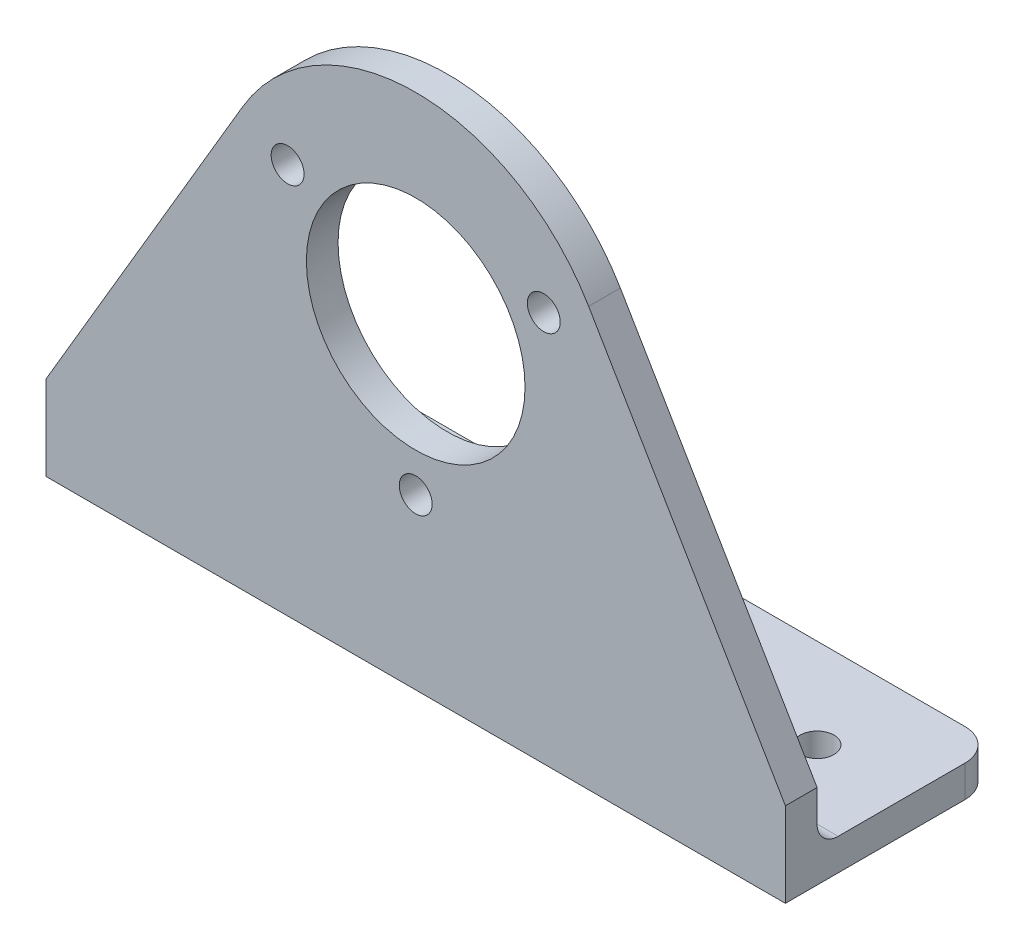
ISO-10303-21;
HEADER;
FILE_DESCRIPTION(('STEP AP214'),'2;1');
FILE_NAME('part.step','',(''),(''),'','','');
FILE_SCHEMA(('AUTOMOTIVE_DESIGN { 1 0 10303 214 1 1 1 1 }'));
ENDSEC;
DATA;
#1=APPLICATION_CONTEXT('core data for automotive mechanical design processes');
#2=APPLICATION_PROTOCOL_DEFINITION('international standard','automotive_design',2000,#1);
#3=PRODUCT_CONTEXT('',#1,'mechanical');
#4=PRODUCT('Part','Part','',(#3));
#5=PRODUCT_RELATED_PRODUCT_CATEGORY('part','',(#4));
#6=PRODUCT_DEFINITION_FORMATION('','',#4);
#7=PRODUCT_DEFINITION_CONTEXT('part definition',#1,'design');
#8=PRODUCT_DEFINITION('design','',#6,#7);
#9=PRODUCT_DEFINITION_SHAPE('','',#8);
#10=(LENGTH_UNIT() NAMED_UNIT(*) SI_UNIT(.MILLI.,.METRE.));
#11=(NAMED_UNIT(*) PLANE_ANGLE_UNIT() SI_UNIT($,.RADIAN.));
#12=(NAMED_UNIT(*) SI_UNIT($,.STERADIAN.) SOLID_ANGLE_UNIT());
#13=UNCERTAINTY_MEASURE_WITH_UNIT(LENGTH_MEASURE(1.E-05),#10,'distance_accuracy_value','');
#14=(GEOMETRIC_REPRESENTATION_CONTEXT(3) GLOBAL_UNCERTAINTY_ASSIGNED_CONTEXT((#13)) GLOBAL_UNIT_ASSIGNED_CONTEXT((#10,
#11,#12)) REPRESENTATION_CONTEXT('',''));
#15=CARTESIAN_POINT('',(0.,0.,0.));
#16=DIRECTION('',(0.,0.,1.));
#17=DIRECTION('',(1.,0.,0.));
#18=AXIS2_PLACEMENT_3D('',#15,#16,#17);
#19=CARTESIAN_POINT('',(0.,3.,0.));
#20=DIRECTION('',(1.,0.,0.));
#21=DIRECTION('',(0.,0.,-1.));
#22=AXIS2_PLACEMENT_3D('',#19,#20,#21);
#23=PLANE('',#22);
#24=DIRECTION('',(0.,0.,1.));
#25=VECTOR('',#24,1.);
#26=CARTESIAN_POINT('',(0.,3.,0.));
#27=LINE('',#26,#25);
#28=CARTESIAN_POINT('',(0.,3.,-14.));
#29=VERTEX_POINT('',#28);
#30=CARTESIAN_POINT('',(0.,3.,-2.));
#31=VERTEX_POINT('',#30);
#32=EDGE_CURVE('E181',#29,#31,#27,.T.);
#33=ORIENTED_EDGE('',*,*,#32,.F.);
#34=DIRECTION('',(0.,-1.,0.));
#35=VECTOR('',#34,1.);
#36=CARTESIAN_POINT('',(0.,3.,-14.));
#37=LINE('',#36,#35);
#38=CARTESIAN_POINT('',(0.,0.,-14.));
#39=VERTEX_POINT('',#38);
#40=EDGE_CURVE('E127',#29,#39,#37,.T.);
#41=ORIENTED_EDGE('',*,*,#40,.T.);
#42=DIRECTION('',(0.,0.,1.));
#43=VECTOR('',#42,1.);
#44=CARTESIAN_POINT('',(0.,0.,0.));
#45=LINE('',#44,#43);
#46=CARTESIAN_POINT('',(0.,0.,3.));
#47=VERTEX_POINT('',#46);
#48=EDGE_CURVE('E120',#39,#47,#45,.T.);
#49=ORIENTED_EDGE('',*,*,#48,.T.);
#50=DIRECTION('',(0.,-1.,0.));
#51=VECTOR('',#50,1.);
#52=CARTESIAN_POINT('',(0.,8.,3.));
#53=LINE('',#52,#51);
#54=CARTESIAN_POINT('',(0.,8.,3.));
#55=VERTEX_POINT('',#54);
#56=EDGE_CURVE('E125',#55,#47,#53,.T.);
#57=ORIENTED_EDGE('',*,*,#56,.F.);
#58=DIRECTION('',(0.,0.,-1.));
#59=VECTOR('',#58,1.);
#60=CARTESIAN_POINT('',(0.,8.,3.));
#61=LINE('',#60,#59);
#62=CARTESIAN_POINT('',(0.,8.,0.));
#63=VERTEX_POINT('',#62);
#64=EDGE_CURVE('E160',#55,#63,#61,.T.);
#65=ORIENTED_EDGE('',*,*,#64,.T.);
#66=DIRECTION('',(0.,-1.,0.));
#67=VECTOR('',#66,1.);
#68=CARTESIAN_POINT('',(0.,8.,0.));
#69=LINE('',#68,#67);
#70=CARTESIAN_POINT('',(0.,5.,0.));
#71=VERTEX_POINT('',#70);
#72=EDGE_CURVE('E166',#63,#71,#69,.T.);
#73=ORIENTED_EDGE('',*,*,#72,.T.);
#74=CARTESIAN_POINT('',(0.,5.,-2.));
#75=DIRECTION('',(1.,0.,0.));
#76=DIRECTION('',(0.,0.,-1.));
#77=AXIS2_PLACEMENT_3D('',#74,#75,#76);
#78=CIRCLE('',#77,2.);
#79=EDGE_CURVE('E11',#71,#31,#78,.T.);
#80=ORIENTED_EDGE('',*,*,#79,.T.);
#81=EDGE_LOOP('',(#33,#41,#49,#57,#65,#73,#80));
#82=FACE_BOUND('',#81,.T.);
#83=ADVANCED_FACE('F37',(#82),#23,.F.);
#84=CARTESIAN_POINT('',(70.,3.,0.));
#85=DIRECTION('',(-1.,0.,0.));
#86=DIRECTION('',(0.,0.,1.));
#87=AXIS2_PLACEMENT_3D('',#84,#85,#86);
#88=PLANE('',#87);
#89=DIRECTION('',(0.,0.,-1.));
#90=VECTOR('',#89,1.);
#91=CARTESIAN_POINT('',(70.,0.,0.));
#92=LINE('',#91,#90);
#93=CARTESIAN_POINT('',(70.,0.,3.));
#94=VERTEX_POINT('',#93);
#95=CARTESIAN_POINT('',(70.,0.,-14.));
#96=VERTEX_POINT('',#95);
#97=EDGE_CURVE('E129',#94,#96,#92,.T.);
#98=ORIENTED_EDGE('',*,*,#97,.T.);
#99=DIRECTION('',(0.,-1.,0.));
#100=VECTOR('',#99,1.);
#101=CARTESIAN_POINT('',(70.,3.,-14.));
#102=LINE('',#101,#100);
#103=CARTESIAN_POINT('',(70.,3.,-14.));
#104=VERTEX_POINT('',#103);
#105=EDGE_CURVE('E229',#96,#104,#102,.F.);
#106=ORIENTED_EDGE('',*,*,#105,.T.);
#107=DIRECTION('',(0.,0.,-1.));
#108=VECTOR('',#107,1.);
#109=CARTESIAN_POINT('',(70.,3.,0.));
#110=LINE('',#109,#108);
#111=CARTESIAN_POINT('',(70.,3.,-2.));
#112=VERTEX_POINT('',#111);
#113=EDGE_CURVE('E175',#112,#104,#110,.T.);
#114=ORIENTED_EDGE('',*,*,#113,.F.);
#115=CARTESIAN_POINT('',(70.,5.,-2.));
#116=DIRECTION('',(-1.,0.,0.));
#117=DIRECTION('',(0.,0.,1.));
#118=AXIS2_PLACEMENT_3D('',#115,#116,#117);
#119=CIRCLE('',#118,2.);
#120=CARTESIAN_POINT('',(70.,5.,0.));
#121=VERTEX_POINT('',#120);
#122=EDGE_CURVE('E45',#112,#121,#119,.T.);
#123=ORIENTED_EDGE('',*,*,#122,.T.);
#124=DIRECTION('',(0.,1.,0.));
#125=VECTOR('',#124,1.);
#126=CARTESIAN_POINT('',(70.,0.,0.));
#127=LINE('',#126,#125);
#128=CARTESIAN_POINT('',(70.,8.,0.));
#129=VERTEX_POINT('',#128);
#130=EDGE_CURVE('E169',#121,#129,#127,.T.);
#131=ORIENTED_EDGE('',*,*,#130,.T.);
#132=DIRECTION('',(0.,0.,-1.));
#133=VECTOR('',#132,1.);
#134=CARTESIAN_POINT('',(70.,8.,3.));
#135=LINE('',#134,#133);
#136=CARTESIAN_POINT('',(70.,8.,3.));
#137=VERTEX_POINT('',#136);
#138=EDGE_CURVE('E130',#137,#129,#135,.T.);
#139=ORIENTED_EDGE('',*,*,#138,.F.);
#140=DIRECTION('',(0.,1.,0.));
#141=VECTOR('',#140,1.);
#142=CARTESIAN_POINT('',(70.,0.,3.));
#143=LINE('',#142,#141);
#144=EDGE_CURVE('E139',#94,#137,#143,.T.);
#145=ORIENTED_EDGE('',*,*,#144,.F.);
#146=EDGE_LOOP('',(#98,#106,#114,#123,#131,#139,#145));
#147=FACE_BOUND('',#146,.T.);
#148=ADVANCED_FACE('F227',(#147),#88,.F.);
#149=CARTESIAN_POINT('',(0.,3.,-17.));
#150=DIRECTION('',(0.,0.,1.));
#151=DIRECTION('',(1.,0.,0.));
#152=AXIS2_PLACEMENT_3D('',#149,#150,#151);
#153=PLANE('',#152);
#154=DIRECTION('',(-1.,0.,0.));
#155=VECTOR('',#154,1.);
#156=CARTESIAN_POINT('',(0.,3.,-17.));
#157=LINE('',#156,#155);
#158=CARTESIAN_POINT('',(67.,3.,-17.));
#159=VERTEX_POINT('',#158);
#160=CARTESIAN_POINT('',(3.,3.,-17.));
#161=VERTEX_POINT('',#160);
#162=EDGE_CURVE('E172',#159,#161,#157,.T.);
#163=ORIENTED_EDGE('',*,*,#162,.F.);
#164=DIRECTION('',(0.,-1.,0.));
#165=VECTOR('',#164,1.);
#166=CARTESIAN_POINT('',(67.,3.,-17.));
#167=LINE('',#166,#165);
#168=CARTESIAN_POINT('',(67.,0.,-17.));
#169=VERTEX_POINT('',#168);
#170=EDGE_CURVE('E239',#159,#169,#167,.T.);
#171=ORIENTED_EDGE('',*,*,#170,.T.);
#172=DIRECTION('',(-1.,0.,0.));
#173=VECTOR('',#172,1.);
#174=CARTESIAN_POINT('',(0.,0.,-17.));
#175=LINE('',#174,#173);
#176=CARTESIAN_POINT('',(3.,0.,-17.));
#177=VERTEX_POINT('',#176);
#178=EDGE_CURVE('E178',#169,#177,#175,.T.);
#179=ORIENTED_EDGE('',*,*,#178,.T.);
#180=DIRECTION('',(0.,-1.,0.));
#181=VECTOR('',#180,1.);
#182=CARTESIAN_POINT('',(3.,3.,-17.));
#183=LINE('',#182,#181);
#184=EDGE_CURVE('E174',#177,#161,#183,.F.);
#185=ORIENTED_EDGE('',*,*,#184,.T.);
#186=EDGE_LOOP('',(#163,#171,#179,#185));
#187=FACE_BOUND('',#186,.T.);
#188=ADVANCED_FACE('F249',(#187),#153,.F.);
#189=CARTESIAN_POINT('',(0.,3.,0.));
#190=DIRECTION('',(0.,-1.,0.));
#191=DIRECTION('',(0.,0.,-1.));
#192=AXIS2_PLACEMENT_3D('',#189,#190,#191);
#193=PLANE('',#192);
#194=CARTESIAN_POINT('',(61.5,3.,-8.5));
#195=DIRECTION('',(0.,1.,0.));
#196=DIRECTION('',(0.,0.,1.));
#197=AXIS2_PLACEMENT_3D('',#194,#195,#196);
#198=CIRCLE('',#197,1.6);
#199=CARTESIAN_POINT('',(61.5,3.,-6.9));
#200=VERTEX_POINT('',#199);
#201=EDGE_CURVE('E316',#200,#200,#198,.T.);
#202=ORIENTED_EDGE('',*,*,#201,.F.);
#203=EDGE_LOOP('',(#202));
#204=FACE_BOUND('',#203,.T.);
#205=CARTESIAN_POINT('',(8.5,3.,-8.5));
#206=DIRECTION('',(0.,1.,0.));
#207=DIRECTION('',(0.,0.,1.));
#208=AXIS2_PLACEMENT_3D('',#205,#206,#207);
#209=CIRCLE('',#208,1.6);
#210=CARTESIAN_POINT('',(8.5,3.,-6.9));
#211=VERTEX_POINT('',#210);
#212=EDGE_CURVE('E318',#211,#211,#209,.T.);
#213=ORIENTED_EDGE('',*,*,#212,.F.);
#214=EDGE_LOOP('',(#213));
#215=FACE_BOUND('',#214,.T.);
#216=ORIENTED_EDGE('',*,*,#32,.T.);
#217=DIRECTION('',(1.,0.,0.));
#218=VECTOR('',#217,1.);
#219=CARTESIAN_POINT('',(70.,3.,-2.));
#220=LINE('',#219,#218);
#221=EDGE_CURVE('E190',#31,#112,#220,.T.);
#222=ORIENTED_EDGE('',*,*,#221,.T.);
#223=ORIENTED_EDGE('',*,*,#113,.T.);
#224=CARTESIAN_POINT('',(67.,3.,-14.));
#225=DIRECTION('',(0.,-1.,0.));
#226=DIRECTION('',(0.,0.,-1.));
#227=AXIS2_PLACEMENT_3D('',#224,#225,#226);
#228=CIRCLE('',#227,3.);
#229=EDGE_CURVE('E236',#104,#159,#228,.F.);
#230=ORIENTED_EDGE('',*,*,#229,.T.);
#231=ORIENTED_EDGE('',*,*,#162,.T.);
#232=CARTESIAN_POINT('',(3.,3.,-14.));
#233=DIRECTION('',(0.,-1.,0.));
#234=DIRECTION('',(0.,0.,-1.));
#235=AXIS2_PLACEMENT_3D('',#232,#233,#234);
#236=CIRCLE('',#235,3.);
#237=EDGE_CURVE('E232',#161,#29,#236,.F.);
#238=ORIENTED_EDGE('',*,*,#237,.T.);
#239=EDGE_LOOP('',(#216,#222,#223,#230,#231,#238));
#240=FACE_BOUND('',#239,.T.);
#241=ADVANCED_FACE('F225',(#204,#215,#240),#193,.F.);
#242=CARTESIAN_POINT('',(0.,0.,0.));
#243=DIRECTION('',(0.,-1.,0.));
#244=DIRECTION('',(0.,0.,-1.));
#245=AXIS2_PLACEMENT_3D('',#242,#243,#244);
#246=PLANE('',#245);
#247=CARTESIAN_POINT('',(61.5,0.,-8.5));
#248=DIRECTION('',(0.,1.,0.));
#249=DIRECTION('',(0.,0.,1.));
#250=AXIS2_PLACEMENT_3D('',#247,#248,#249);
#251=CIRCLE('',#250,1.6);
#252=CARTESIAN_POINT('',(61.5,0.,-6.9));
#253=VERTEX_POINT('',#252);
#254=EDGE_CURVE('E313',#253,#253,#251,.T.);
#255=ORIENTED_EDGE('',*,*,#254,.T.);
#256=EDGE_LOOP('',(#255));
#257=FACE_BOUND('',#256,.T.);
#258=CARTESIAN_POINT('',(8.5,0.,-8.5));
#259=DIRECTION('',(0.,1.,0.));
#260=DIRECTION('',(0.,0.,1.));
#261=AXIS2_PLACEMENT_3D('',#258,#259,#260);
#262=CIRCLE('',#261,1.6);
#263=CARTESIAN_POINT('',(8.5,0.,-6.9));
#264=VERTEX_POINT('',#263);
#265=EDGE_CURVE('E321',#264,#264,#262,.T.);
#266=ORIENTED_EDGE('',*,*,#265,.T.);
#267=EDGE_LOOP('',(#266));
#268=FACE_BOUND('',#267,.T.);
#269=ORIENTED_EDGE('',*,*,#178,.F.);
#270=CARTESIAN_POINT('',(67.,0.,-14.));
#271=DIRECTION('',(0.,-1.,0.));
#272=DIRECTION('',(0.,0.,-1.));
#273=AXIS2_PLACEMENT_3D('',#270,#271,#272);
#274=CIRCLE('',#273,3.);
#275=EDGE_CURVE('E233',#169,#96,#274,.T.);
#276=ORIENTED_EDGE('',*,*,#275,.T.);
#277=ORIENTED_EDGE('',*,*,#97,.F.);
#278=DIRECTION('',(1.,0.,0.));
#279=VECTOR('',#278,1.);
#280=CARTESIAN_POINT('',(0.,0.,3.));
#281=LINE('',#280,#279);
#282=EDGE_CURVE('E133',#47,#94,#281,.T.);
#283=ORIENTED_EDGE('',*,*,#282,.F.);
#284=ORIENTED_EDGE('',*,*,#48,.F.);
#285=CARTESIAN_POINT('',(3.,0.,-14.));
#286=DIRECTION('',(0.,-1.,0.));
#287=DIRECTION('',(0.,0.,-1.));
#288=AXIS2_PLACEMENT_3D('',#285,#286,#287);
#289=CIRCLE('',#288,3.);
#290=EDGE_CURVE('E245',#39,#177,#289,.T.);
#291=ORIENTED_EDGE('',*,*,#290,.T.);
#292=EDGE_LOOP('',(#269,#276,#277,#283,#284,#291));
#293=FACE_BOUND('',#292,.T.);
#294=ADVANCED_FACE('F135',(#257,#268,#293),#246,.T.);
#295=CARTESIAN_POINT('',(35.,30.,3.));
#296=DIRECTION('',(0.,0.,1.));
#297=DIRECTION('',(1.,0.,0.));
#298=AXIS2_PLACEMENT_3D('',#295,#296,#297);
#299=PLANE('',#298);
#300=CARTESIAN_POINT('',(22.8756443470179,37.0000000000001,3.));
#301=DIRECTION('',(0.,0.,1.));
#302=DIRECTION('',(1.,0.,0.));
#303=AXIS2_PLACEMENT_3D('',#300,#301,#302);
#304=CIRCLE('',#303,1.55914497782311);
#305=CARTESIAN_POINT('',(24.434789324841,37.0000000000001,3.));
#306=VERTEX_POINT('',#305);
#307=EDGE_CURVE('E333',#306,#306,#304,.T.);
#308=ORIENTED_EDGE('',*,*,#307,.F.);
#309=EDGE_LOOP('',(#308));
#310=FACE_BOUND('',#309,.T.);
#311=CARTESIAN_POINT('',(35.,30.,3.));
#312=DIRECTION('',(0.,0.,1.));
#313=DIRECTION('',(1.,0.,0.));
#314=AXIS2_PLACEMENT_3D('',#311,#312,#313);
#315=CIRCLE('',#314,10.35);
#316=CARTESIAN_POINT('',(45.35,30.,3.));
#317=VERTEX_POINT('',#316);
#318=EDGE_CURVE('E170',#317,#317,#315,.T.);
#319=ORIENTED_EDGE('',*,*,#318,.F.);
#320=EDGE_LOOP('',(#319));
#321=FACE_BOUND('',#320,.T.);
#322=ORIENTED_EDGE('',*,*,#56,.T.);
#323=ORIENTED_EDGE('',*,*,#282,.T.);
#324=ORIENTED_EDGE('',*,*,#144,.T.);
#325=DIRECTION('',(-0.507331294644825,0.861751099491034,0.));
#326=VECTOR('',#325,1.);
#327=CARTESIAN_POINT('',(70.,8.,3.));
#328=LINE('',#327,#326);
#329=CARTESIAN_POINT('',(51.3732708903297,39.6392945982517,3.));
#330=VERTEX_POINT('',#329);
#331=EDGE_CURVE('E155',#137,#330,#328,.T.);
#332=ORIENTED_EDGE('',*,*,#331,.T.);
#333=CARTESIAN_POINT('',(35.,30.,3.));
#334=DIRECTION('',(0.,0.,1.));
#335=DIRECTION('',(1.,0.,0.));
#336=AXIS2_PLACEMENT_3D('',#333,#334,#335);
#337=CIRCLE('',#336,19.);
#338=CARTESIAN_POINT('',(18.6267291096704,39.6392945982517,3.));
#339=VERTEX_POINT('',#338);
#340=EDGE_CURVE('E157',#330,#339,#337,.T.);
#341=ORIENTED_EDGE('',*,*,#340,.T.);
#342=DIRECTION('',(-0.507331294644826,-0.861751099491033,0.));
#343=VECTOR('',#342,1.);
#344=CARTESIAN_POINT('',(0.,8.,3.));
#345=LINE('',#344,#343);
#346=EDGE_CURVE('E144',#339,#55,#345,.T.);
#347=ORIENTED_EDGE('',*,*,#346,.T.);
#348=EDGE_LOOP('',(#322,#323,#324,#332,#341,#347));
#349=FACE_BOUND('',#348,.T.);
#350=CARTESIAN_POINT('',(35.,16.,3.));
#351=DIRECTION('',(0.,0.,1.));
#352=DIRECTION('',(1.,0.,0.));
#353=AXIS2_PLACEMENT_3D('',#350,#351,#352);
#354=CIRCLE('',#353,1.55914497782311);
#355=CARTESIAN_POINT('',(36.5591449778231,16.,3.));
#356=VERTEX_POINT('',#355);
#357=EDGE_CURVE('E339',#356,#356,#354,.T.);
#358=ORIENTED_EDGE('',*,*,#357,.F.);
#359=EDGE_LOOP('',(#358));
#360=FACE_BOUND('',#359,.T.);
#361=CARTESIAN_POINT('',(47.1243556529822,36.9999999999999,3.));
#362=DIRECTION('',(0.,0.,1.));
#363=DIRECTION('',(1.,0.,0.));
#364=AXIS2_PLACEMENT_3D('',#361,#362,#363);
#365=CIRCLE('',#364,1.5591449778231);
#366=CARTESIAN_POINT('',(48.6835006308053,36.9999999999999,3.));
#367=VERTEX_POINT('',#366);
#368=EDGE_CURVE('E327',#367,#367,#365,.T.);
#369=ORIENTED_EDGE('',*,*,#368,.F.);
#370=EDGE_LOOP('',(#369));
#371=FACE_BOUND('',#370,.T.);
#372=ADVANCED_FACE('F141',(#310,#321,#349,#360,#371),#299,.T.);
#373=CARTESIAN_POINT('',(35.,30.,0.));
#374=DIRECTION('',(0.,0.,1.));
#375=DIRECTION('',(1.,0.,0.));
#376=AXIS2_PLACEMENT_3D('',#373,#374,#375);
#377=PLANE('',#376);
#378=ORIENTED_EDGE('',*,*,#130,.F.);
#379=DIRECTION('',(1.,0.,0.));
#380=VECTOR('',#379,1.);
#381=CARTESIAN_POINT('',(0.,5.,0.));
#382=LINE('',#381,#380);
#383=EDGE_CURVE('E58',#121,#71,#382,.F.);
#384=ORIENTED_EDGE('',*,*,#383,.T.);
#385=ORIENTED_EDGE('',*,*,#72,.F.);
#386=DIRECTION('',(-0.507331294644826,-0.861751099491033,0.));
#387=VECTOR('',#386,1.);
#388=CARTESIAN_POINT('',(0.,8.,0.));
#389=LINE('',#388,#387);
#390=CARTESIAN_POINT('',(18.6267291096704,39.6392945982517,0.));
#391=VERTEX_POINT('',#390);
#392=EDGE_CURVE('E146',#391,#63,#389,.T.);
#393=ORIENTED_EDGE('',*,*,#392,.F.);
#394=CARTESIAN_POINT('',(35.,30.,0.));
#395=DIRECTION('',(0.,0.,1.));
#396=DIRECTION('',(1.,0.,0.));
#397=AXIS2_PLACEMENT_3D('',#394,#395,#396);
#398=CIRCLE('',#397,19.);
#399=CARTESIAN_POINT('',(51.3732708903297,39.6392945982517,0.));
#400=VERTEX_POINT('',#399);
#401=EDGE_CURVE('E148',#400,#391,#398,.T.);
#402=ORIENTED_EDGE('',*,*,#401,.F.);
#403=DIRECTION('',(-0.507331294644825,0.861751099491034,0.));
#404=VECTOR('',#403,1.);
#405=CARTESIAN_POINT('',(70.,8.,0.));
#406=LINE('',#405,#404);
#407=EDGE_CURVE('E195',#129,#400,#406,.T.);
#408=ORIENTED_EDGE('',*,*,#407,.F.);
#409=EDGE_LOOP('',(#378,#384,#385,#393,#402,#408));
#410=FACE_BOUND('',#409,.T.);
#411=CARTESIAN_POINT('',(22.8756443470179,37.0000000000001,0.));
#412=DIRECTION('',(0.,0.,1.));
#413=DIRECTION('',(1.,0.,0.));
#414=AXIS2_PLACEMENT_3D('',#411,#412,#413);
#415=CIRCLE('',#414,1.55914497782311);
#416=CARTESIAN_POINT('',(24.434789324841,37.0000000000001,0.));
#417=VERTEX_POINT('',#416);
#418=EDGE_CURVE('E330',#417,#417,#415,.T.);
#419=ORIENTED_EDGE('',*,*,#418,.T.);
#420=EDGE_LOOP('',(#419));
#421=FACE_BOUND('',#420,.T.);
#422=CARTESIAN_POINT('',(35.,30.,0.));
#423=DIRECTION('',(0.,0.,1.));
#424=DIRECTION('',(1.,0.,0.));
#425=AXIS2_PLACEMENT_3D('',#422,#423,#424);
#426=CIRCLE('',#425,10.35);
#427=CARTESIAN_POINT('',(45.35,30.,0.));
#428=VERTEX_POINT('',#427);
#429=EDGE_CURVE('E151',#428,#428,#426,.T.);
#430=ORIENTED_EDGE('',*,*,#429,.T.);
#431=EDGE_LOOP('',(#430));
#432=FACE_BOUND('',#431,.T.);
#433=CARTESIAN_POINT('',(35.,16.,0.));
#434=DIRECTION('',(0.,0.,1.));
#435=DIRECTION('',(1.,0.,0.));
#436=AXIS2_PLACEMENT_3D('',#433,#434,#435);
#437=CIRCLE('',#436,1.55914497782311);
#438=CARTESIAN_POINT('',(36.5591449778231,16.,0.));
#439=VERTEX_POINT('',#438);
#440=EDGE_CURVE('E336',#439,#439,#437,.T.);
#441=ORIENTED_EDGE('',*,*,#440,.T.);
#442=EDGE_LOOP('',(#441));
#443=FACE_BOUND('',#442,.T.);
#444=CARTESIAN_POINT('',(47.1243556529822,36.9999999999999,0.));
#445=DIRECTION('',(0.,0.,1.));
#446=DIRECTION('',(1.,0.,0.));
#447=AXIS2_PLACEMENT_3D('',#444,#445,#446);
#448=CIRCLE('',#447,1.5591449778231);
#449=CARTESIAN_POINT('',(48.6835006308053,36.9999999999999,0.));
#450=VERTEX_POINT('',#449);
#451=EDGE_CURVE('E324',#450,#450,#448,.T.);
#452=ORIENTED_EDGE('',*,*,#451,.T.);
#453=EDGE_LOOP('',(#452));
#454=FACE_BOUND('',#453,.T.);
#455=ADVANCED_FACE('F213',(#410,#421,#432,#443,#454),#377,.F.);
#456=CARTESIAN_POINT('',(70.,8.,3.));
#457=DIRECTION('',(-0.861751099491034,-0.507331294644825,0.));
#458=DIRECTION('',(0.507331294644825,-0.861751099491034,0.));
#459=AXIS2_PLACEMENT_3D('',#456,#457,#458);
#460=PLANE('',#459);
#461=ORIENTED_EDGE('',*,*,#407,.T.);
#462=DIRECTION('',(0.,0.,-1.));
#463=VECTOR('',#462,1.);
#464=CARTESIAN_POINT('',(51.3732708903297,39.6392945982517,3.));
#465=LINE('',#464,#463);
#466=EDGE_CURVE('E207',#330,#400,#465,.T.);
#467=ORIENTED_EDGE('',*,*,#466,.F.);
#468=ORIENTED_EDGE('',*,*,#331,.F.);
#469=ORIENTED_EDGE('',*,*,#138,.T.);
#470=EDGE_LOOP('',(#461,#467,#468,#469));
#471=FACE_BOUND('',#470,.T.);
#472=ADVANCED_FACE('F212',(#471),#460,.F.);
#473=CARTESIAN_POINT('',(35.,30.,3.));
#474=DIRECTION('',(0.,0.,-1.));
#475=DIRECTION('',(-1.,0.,0.));
#476=AXIS2_PLACEMENT_3D('',#473,#474,#475);
#477=CYLINDRICAL_SURFACE('',#476,19.);
#478=ORIENTED_EDGE('',*,*,#401,.T.);
#479=DIRECTION('',(0.,0.,-1.));
#480=VECTOR('',#479,1.);
#481=CARTESIAN_POINT('',(18.6267291096704,39.6392945982517,3.));
#482=LINE('',#481,#480);
#483=EDGE_CURVE('E205',#339,#391,#482,.T.);
#484=ORIENTED_EDGE('',*,*,#483,.F.);
#485=ORIENTED_EDGE('',*,*,#340,.F.);
#486=ORIENTED_EDGE('',*,*,#466,.T.);
#487=EDGE_LOOP('',(#478,#484,#485,#486));
#488=FACE_BOUND('',#487,.T.);
#489=ADVANCED_FACE('F217',(#488),#477,.T.);
#490=CARTESIAN_POINT('',(0.,8.,3.));
#491=DIRECTION('',(0.861751099491033,-0.507331294644826,0.));
#492=DIRECTION('',(0.507331294644826,0.861751099491033,0.));
#493=AXIS2_PLACEMENT_3D('',#490,#491,#492);
#494=PLANE('',#493);
#495=ORIENTED_EDGE('',*,*,#392,.T.);
#496=ORIENTED_EDGE('',*,*,#64,.F.);
#497=ORIENTED_EDGE('',*,*,#346,.F.);
#498=ORIENTED_EDGE('',*,*,#483,.T.);
#499=EDGE_LOOP('',(#495,#496,#497,#498));
#500=FACE_BOUND('',#499,.T.);
#501=ADVANCED_FACE('F219',(#500),#494,.F.);
#502=CARTESIAN_POINT('',(35.,30.,3.));
#503=DIRECTION('',(0.,0.,-1.));
#504=DIRECTION('',(-1.,0.,0.));
#505=AXIS2_PLACEMENT_3D('',#502,#503,#504);
#506=CYLINDRICAL_SURFACE('',#505,10.35);
#507=ORIENTED_EDGE('',*,*,#318,.T.);
#508=EDGE_LOOP('',(#507));
#509=FACE_BOUND('',#508,.T.);
#510=ORIENTED_EDGE('',*,*,#429,.F.);
#511=EDGE_LOOP('',(#510));
#512=FACE_BOUND('',#511,.T.);
#513=ADVANCED_FACE('F281',(#509,#512),#506,.F.);
#514=CARTESIAN_POINT('',(35.,16.,3.));
#515=DIRECTION('',(0.,0.,-1.));
#516=DIRECTION('',(-1.,0.,0.));
#517=AXIS2_PLACEMENT_3D('',#514,#515,#516);
#518=CYLINDRICAL_SURFACE('',#517,1.55914497782311);
#519=ORIENTED_EDGE('',*,*,#357,.T.);
#520=EDGE_LOOP('',(#519));
#521=FACE_BOUND('',#520,.T.);
#522=ORIENTED_EDGE('',*,*,#440,.F.);
#523=EDGE_LOOP('',(#522));
#524=FACE_BOUND('',#523,.T.);
#525=ADVANCED_FACE('F289',(#521,#524),#518,.F.);
#526=CARTESIAN_POINT('',(22.8756443470179,37.0000000000001,3.));
#527=DIRECTION('',(0.,0.,-1.));
#528=DIRECTION('',(-1.,0.,0.));
#529=AXIS2_PLACEMENT_3D('',#526,#527,#528);
#530=CYLINDRICAL_SURFACE('',#529,1.55914497782311);
#531=ORIENTED_EDGE('',*,*,#307,.T.);
#532=EDGE_LOOP('',(#531));
#533=FACE_BOUND('',#532,.T.);
#534=ORIENTED_EDGE('',*,*,#418,.F.);
#535=EDGE_LOOP('',(#534));
#536=FACE_BOUND('',#535,.T.);
#537=ADVANCED_FACE('F293',(#533,#536),#530,.F.);
#538=CARTESIAN_POINT('',(47.1243556529822,36.9999999999999,3.));
#539=DIRECTION('',(0.,0.,-1.));
#540=DIRECTION('',(-1.,0.,0.));
#541=AXIS2_PLACEMENT_3D('',#538,#539,#540);
#542=CYLINDRICAL_SURFACE('',#541,1.5591449778231);
#543=ORIENTED_EDGE('',*,*,#368,.T.);
#544=EDGE_LOOP('',(#543));
#545=FACE_BOUND('',#544,.T.);
#546=ORIENTED_EDGE('',*,*,#451,.F.);
#547=EDGE_LOOP('',(#546));
#548=FACE_BOUND('',#547,.T.);
#549=ADVANCED_FACE('F297',(#545,#548),#542,.F.);
#550=CARTESIAN_POINT('',(8.5,0.,-8.5));
#551=DIRECTION('',(0.,1.,0.));
#552=DIRECTION('',(0.,0.,1.));
#553=AXIS2_PLACEMENT_3D('',#550,#551,#552);
#554=CYLINDRICAL_SURFACE('',#553,1.6);
#555=ORIENTED_EDGE('',*,*,#265,.F.);
#556=EDGE_LOOP('',(#555));
#557=FACE_BOUND('',#556,.T.);
#558=ORIENTED_EDGE('',*,*,#212,.T.);
#559=EDGE_LOOP('',(#558));
#560=FACE_BOUND('',#559,.T.);
#561=ADVANCED_FACE('F301',(#557,#560),#554,.F.);
#562=CARTESIAN_POINT('',(61.5,0.,-8.5));
#563=DIRECTION('',(0.,1.,0.));
#564=DIRECTION('',(0.,0.,1.));
#565=AXIS2_PLACEMENT_3D('',#562,#563,#564);
#566=CYLINDRICAL_SURFACE('',#565,1.6);
#567=ORIENTED_EDGE('',*,*,#254,.F.);
#568=EDGE_LOOP('',(#567));
#569=FACE_BOUND('',#568,.T.);
#570=ORIENTED_EDGE('',*,*,#201,.T.);
#571=EDGE_LOOP('',(#570));
#572=FACE_BOUND('',#571,.T.);
#573=ADVANCED_FACE('F258',(#569,#572),#566,.F.);
#574=CARTESIAN_POINT('',(67.,3.,-14.));
#575=DIRECTION('',(0.,-1.,0.));
#576=DIRECTION('',(0.,0.,-1.));
#577=AXIS2_PLACEMENT_3D('',#574,#575,#576);
#578=CYLINDRICAL_SURFACE('',#577,3.);
#579=ORIENTED_EDGE('',*,*,#229,.F.);
#580=ORIENTED_EDGE('',*,*,#105,.F.);
#581=ORIENTED_EDGE('',*,*,#275,.F.);
#582=ORIENTED_EDGE('',*,*,#170,.F.);
#583=EDGE_LOOP('',(#579,#580,#581,#582));
#584=FACE_BOUND('',#583,.T.);
#585=ADVANCED_FACE('F237',(#584),#578,.T.);
#586=CARTESIAN_POINT('',(3.,3.,-14.));
#587=DIRECTION('',(0.,-1.,0.));
#588=DIRECTION('',(0.,0.,-1.));
#589=AXIS2_PLACEMENT_3D('',#586,#587,#588);
#590=CYLINDRICAL_SURFACE('',#589,3.);
#591=ORIENTED_EDGE('',*,*,#237,.F.);
#592=ORIENTED_EDGE('',*,*,#184,.F.);
#593=ORIENTED_EDGE('',*,*,#290,.F.);
#594=ORIENTED_EDGE('',*,*,#40,.F.);
#595=EDGE_LOOP('',(#591,#592,#593,#594));
#596=FACE_BOUND('',#595,.T.);
#597=ADVANCED_FACE('F252',(#596),#590,.T.);
#598=CARTESIAN_POINT('',(0.,5.,-2.));
#599=DIRECTION('',(-1.,0.,0.));
#600=DIRECTION('',(0.,0.,1.));
#601=AXIS2_PLACEMENT_3D('',#598,#599,#600);
#602=CYLINDRICAL_SURFACE('',#601,2.);
#603=ORIENTED_EDGE('',*,*,#79,.F.);
#604=ORIENTED_EDGE('',*,*,#383,.F.);
#605=ORIENTED_EDGE('',*,*,#122,.F.);
#606=ORIENTED_EDGE('',*,*,#221,.F.);
#607=EDGE_LOOP('',(#603,#604,#605,#606));
#608=FACE_BOUND('',#607,.T.);
#609=ADVANCED_FACE('F39',(#608),#602,.F.);
#610=CLOSED_SHELL('',(#83,#148,#188,#241,#294,#372,#455,#472,#489,#501,#513,#525,#537,#549,#561,
#573,#585,#597,#609));
#611=MANIFOLD_SOLID_BREP('B2',#610);
#612=ADVANCED_BREP_SHAPE_REPRESENTATION('',(#18,#611),#14);
#613=SHAPE_DEFINITION_REPRESENTATION(#9,#612);
ENDSEC;
END-ISO-10303-21;
